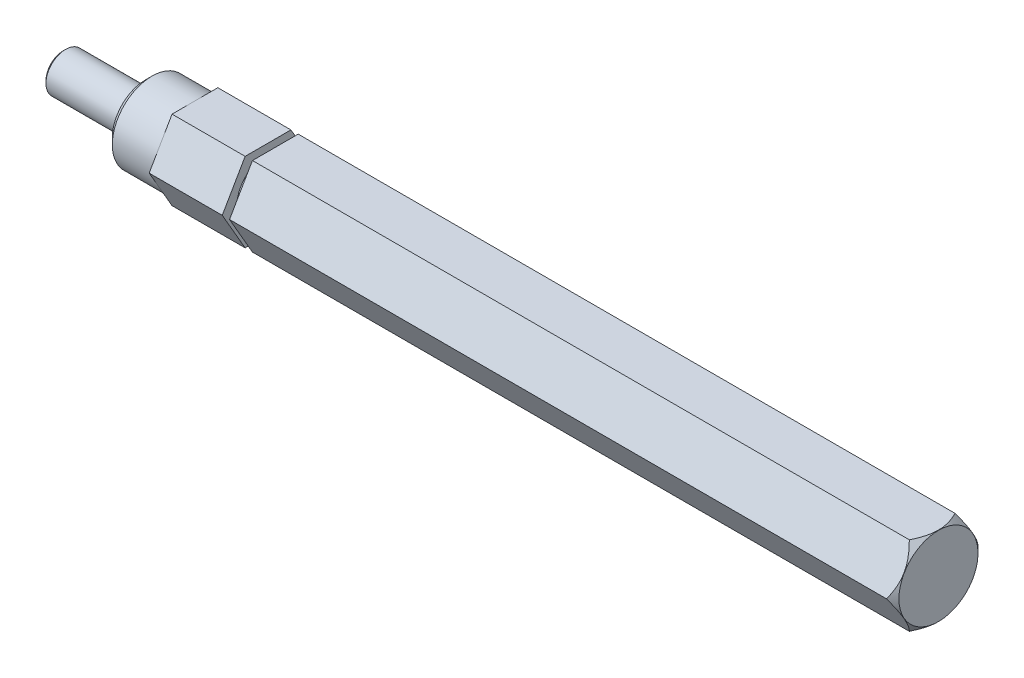
ISO-10303-21;
HEADER;
FILE_DESCRIPTION(('STEP AP214'),'2;1');
FILE_NAME('part.step','',(''),(''),'','','');
FILE_SCHEMA(('AUTOMOTIVE_DESIGN { 1 0 10303 214 1 1 1 1 }'));
ENDSEC;
DATA;
#1=APPLICATION_CONTEXT('core data for automotive mechanical design processes');
#2=APPLICATION_PROTOCOL_DEFINITION('international standard','automotive_design',2000,#1);
#3=PRODUCT_CONTEXT('',#1,'mechanical');
#4=PRODUCT('Part','Part','',(#3));
#5=PRODUCT_RELATED_PRODUCT_CATEGORY('part','',(#4));
#6=PRODUCT_DEFINITION_FORMATION('','',#4);
#7=PRODUCT_DEFINITION_CONTEXT('part definition',#1,'design');
#8=PRODUCT_DEFINITION('design','',#6,#7);
#9=PRODUCT_DEFINITION_SHAPE('','',#8);
#10=(LENGTH_UNIT() NAMED_UNIT(*) SI_UNIT(.MILLI.,.METRE.));
#11=(NAMED_UNIT(*) PLANE_ANGLE_UNIT() SI_UNIT($,.RADIAN.));
#12=(NAMED_UNIT(*) SI_UNIT($,.STERADIAN.) SOLID_ANGLE_UNIT());
#13=UNCERTAINTY_MEASURE_WITH_UNIT(LENGTH_MEASURE(1.E-05),#10,'distance_accuracy_value','');
#14=(GEOMETRIC_REPRESENTATION_CONTEXT(3) GLOBAL_UNCERTAINTY_ASSIGNED_CONTEXT((#13)) GLOBAL_UNIT_ASSIGNED_CONTEXT((#10,
#11,#12)) REPRESENTATION_CONTEXT('',''));
#15=CARTESIAN_POINT('',(0.,0.,0.));
#16=DIRECTION('',(0.,0.,1.));
#17=DIRECTION('',(1.,0.,0.));
#18=AXIS2_PLACEMENT_3D('',#15,#16,#17);
#19=CARTESIAN_POINT('',(-76.708,0.,0.));
#20=DIRECTION('',(-1.,0.,0.));
#21=DIRECTION('',(0.,0.,1.));
#22=AXIS2_PLACEMENT_3D('',#19,#20,#21);
#23=PLANE('',#22);
#24=CARTESIAN_POINT('',(-76.7079999999964,0.,0.));
#25=DIRECTION('',(1.,0.,0.));
#26=DIRECTION('',(0.,0.,-1.));
#27=AXIS2_PLACEMENT_3D('',#24,#25,#26);
#28=CIRCLE('',#27,2.76860000002443);
#29=CARTESIAN_POINT('',(-76.7079999999964,0.,-2.76860000002443));
#30=VERTEX_POINT('',#29);
#31=EDGE_CURVE('E19',#30,#30,#28,.T.);
#32=ORIENTED_EDGE('',*,*,#31,.F.);
#33=EDGE_LOOP('',(#32));
#34=FACE_BOUND('',#33,.T.);
#35=ADVANCED_FACE('F16',(#34),#23,.T.);
#36=CARTESIAN_POINT('',(-76.326999999992,0.,0.));
#37=DIRECTION('',(1.,0.,0.));
#38=DIRECTION('',(0.,0.,-1.));
#39=AXIS2_PLACEMENT_3D('',#36,#37,#38);
#40=CONICAL_SURFACE('',#39,3.149599999972,0.785398163322851);
#41=ORIENTED_EDGE('',*,*,#31,.T.);
#42=EDGE_LOOP('',(#41));
#43=FACE_BOUND('',#42,.T.);
#44=CARTESIAN_POINT('',(-76.327,0.,0.));
#45=DIRECTION('',(1.,0.,0.));
#46=DIRECTION('',(0.,0.,-1.));
#47=AXIS2_PLACEMENT_3D('',#44,#45,#46);
#48=CIRCLE('',#47,3.1496);
#49=CARTESIAN_POINT('',(-76.327,0.,-3.1496));
#50=VERTEX_POINT('',#49);
#51=EDGE_CURVE('E132',#50,#50,#48,.T.);
#52=ORIENTED_EDGE('',*,*,#51,.F.);
#53=EDGE_LOOP('',(#52));
#54=FACE_BOUND('',#53,.T.);
#55=ADVANCED_FACE('F258',(#43,#54),#40,.T.);
#56=CARTESIAN_POINT('',(-76.708,0.,0.));
#57=DIRECTION('',(1.,0.,0.));
#58=DIRECTION('',(0.,0.,-1.));
#59=AXIS2_PLACEMENT_3D('',#56,#57,#58);
#60=CYLINDRICAL_SURFACE('',#59,3.1496);
#61=ORIENTED_EDGE('',*,*,#51,.T.);
#62=EDGE_LOOP('',(#61));
#63=FACE_BOUND('',#62,.T.);
#64=CARTESIAN_POINT('',(-63.5,0.,0.));
#65=DIRECTION('',(1.,0.,0.));
#66=DIRECTION('',(0.,0.,-1.));
#67=AXIS2_PLACEMENT_3D('',#64,#65,#66);
#68=CIRCLE('',#67,3.1496);
#69=CARTESIAN_POINT('',(-63.5,0.,-3.1496));
#70=VERTEX_POINT('',#69);
#71=EDGE_CURVE('E135',#70,#70,#68,.F.);
#72=ORIENTED_EDGE('',*,*,#71,.T.);
#73=EDGE_LOOP('',(#72));
#74=FACE_BOUND('',#73,.T.);
#75=ADVANCED_FACE('F255',(#63,#74),#60,.T.);
#76=CARTESIAN_POINT('',(-63.5,0.,-7.33234841870824));
#77=DIRECTION('',(1.,0.,0.));
#78=DIRECTION('',(0.,0.,-1.));
#79=AXIS2_PLACEMENT_3D('',#76,#77,#78);
#80=PLANE('',#79);
#81=ORIENTED_EDGE('',*,*,#71,.F.);
#82=EDGE_LOOP('',(#81));
#83=FACE_BOUND('',#82,.T.);
#84=CARTESIAN_POINT('',(-63.4999999999764,0.,0.));
#85=DIRECTION('',(1.,0.,0.));
#86=DIRECTION('',(0.,0.,-1.));
#87=AXIS2_PLACEMENT_3D('',#84,#85,#86);
#88=CIRCLE('',#87,5.35000000002128);
#89=CARTESIAN_POINT('',(-63.4999999999764,0.,-5.35000000002128));
#90=VERTEX_POINT('',#89);
#91=EDGE_CURVE('E131',#90,#90,#88,.T.);
#92=ORIENTED_EDGE('',*,*,#91,.F.);
#93=EDGE_LOOP('',(#92));
#94=FACE_BOUND('',#93,.T.);
#95=ADVANCED_FACE('F251',(#83,#94),#80,.F.);
#96=CARTESIAN_POINT('',(-62.5000000001137,0.,0.));
#97=DIRECTION('',(1.,0.,0.));
#98=DIRECTION('',(0.,0.,-1.));
#99=AXIS2_PLACEMENT_3D('',#96,#97,#98);
#100=CONICAL_SURFACE('',#99,6.34999999988395,0.785398163397448);
#101=ORIENTED_EDGE('',*,*,#91,.T.);
#102=EDGE_LOOP('',(#101));
#103=FACE_BOUND('',#102,.T.);
#104=CARTESIAN_POINT('',(-62.5,0.,0.));
#105=DIRECTION('',(-1.,0.,0.));
#106=DIRECTION('',(0.,0.,1.));
#107=AXIS2_PLACEMENT_3D('',#104,#105,#106);
#108=CIRCLE('',#107,6.35);
#109=CARTESIAN_POINT('',(-62.5,0.,6.35));
#110=VERTEX_POINT('',#109);
#111=EDGE_CURVE('E95',#110,#110,#108,.F.);
#112=ORIENTED_EDGE('',*,*,#111,.F.);
#113=EDGE_LOOP('',(#112));
#114=FACE_BOUND('',#113,.T.);
#115=ADVANCED_FACE('F248',(#103,#114),#100,.T.);
#116=CARTESIAN_POINT('',(-55.6133,0.,0.));
#117=DIRECTION('',(-1.,0.,0.));
#118=DIRECTION('',(0.,0.,1.));
#119=AXIS2_PLACEMENT_3D('',#116,#117,#118);
#120=CYLINDRICAL_SURFACE('',#119,6.35);
#121=CARTESIAN_POINT('',(-55.6133,0.,0.));
#122=DIRECTION('',(-1.,0.,0.));
#123=DIRECTION('',(0.,0.,1.));
#124=AXIS2_PLACEMENT_3D('',#121,#122,#123);
#125=CIRCLE('',#124,6.35);
#126=CARTESIAN_POINT('',(-55.6133,-3.17499999999999,-5.49926131403119));
#127=VERTEX_POINT('',#126);
#128=CARTESIAN_POINT('',(-55.6133,3.175,-5.49926131403119));
#129=VERTEX_POINT('',#128);
#130=EDGE_CURVE('E81',#127,#129,#125,.F.);
#131=ORIENTED_EDGE('',*,*,#130,.F.);
#132=CARTESIAN_POINT('',(-55.6133,0.,0.));
#133=DIRECTION('',(-1.,0.,0.));
#134=DIRECTION('',(0.,0.,1.));
#135=AXIS2_PLACEMENT_3D('',#132,#133,#134);
#136=CIRCLE('',#135,6.35);
#137=CARTESIAN_POINT('',(-55.6133,-6.35000000000001,0.));
#138=VERTEX_POINT('',#137);
#139=EDGE_CURVE('E90',#138,#127,#136,.F.);
#140=ORIENTED_EDGE('',*,*,#139,.F.);
#141=CARTESIAN_POINT('',(-55.6133,0.,0.));
#142=DIRECTION('',(-1.,0.,0.));
#143=DIRECTION('',(0.,0.,1.));
#144=AXIS2_PLACEMENT_3D('',#141,#142,#143);
#145=CIRCLE('',#144,6.35);
#146=CARTESIAN_POINT('',(-55.6133,-3.175,5.49926131403118));
#147=VERTEX_POINT('',#146);
#148=EDGE_CURVE('E105',#147,#138,#145,.F.);
#149=ORIENTED_EDGE('',*,*,#148,.F.);
#150=CARTESIAN_POINT('',(-55.6133,0.,0.));
#151=DIRECTION('',(-1.,0.,0.));
#152=DIRECTION('',(0.,0.,1.));
#153=AXIS2_PLACEMENT_3D('',#150,#151,#152);
#154=CIRCLE('',#153,6.35);
#155=CARTESIAN_POINT('',(-55.6133,3.17499999999999,5.49926131403118));
#156=VERTEX_POINT('',#155);
#157=EDGE_CURVE('E106',#156,#147,#154,.F.);
#158=ORIENTED_EDGE('',*,*,#157,.F.);
#159=CARTESIAN_POINT('',(-55.6133,0.,0.));
#160=DIRECTION('',(-1.,0.,0.));
#161=DIRECTION('',(0.,0.,1.));
#162=AXIS2_PLACEMENT_3D('',#159,#160,#161);
#163=CIRCLE('',#162,6.35);
#164=CARTESIAN_POINT('',(-55.6133,6.35,0.));
#165=VERTEX_POINT('',#164);
#166=EDGE_CURVE('E455',#165,#156,#163,.F.);
#167=ORIENTED_EDGE('',*,*,#166,.F.);
#168=CARTESIAN_POINT('',(-55.6133,0.,0.));
#169=DIRECTION('',(-1.,0.,0.));
#170=DIRECTION('',(0.,0.,1.));
#171=AXIS2_PLACEMENT_3D('',#168,#169,#170);
#172=CIRCLE('',#171,6.35);
#173=EDGE_CURVE('E93',#129,#165,#172,.F.);
#174=ORIENTED_EDGE('',*,*,#173,.F.);
#175=EDGE_LOOP('',(#131,#140,#149,#158,#167,#174));
#176=FACE_BOUND('',#175,.T.);
#177=ORIENTED_EDGE('',*,*,#111,.T.);
#178=EDGE_LOOP('',(#177));
#179=FACE_BOUND('',#178,.T.);
#180=ADVANCED_FACE('F87',(#176,#179),#120,.T.);
#181=CARTESIAN_POINT('',(-55.6133,0.,0.));
#182=DIRECTION('',(-1.,0.,0.));
#183=DIRECTION('',(0.,0.,1.));
#184=AXIS2_PLACEMENT_3D('',#181,#182,#183);
#185=PLANE('',#184);
#186=DIRECTION('',(0.,-0.86602540378444,0.499999999999998));
#187=VECTOR('',#186,1.);
#188=CARTESIAN_POINT('',(-55.6133,-6.35000000000002,-3.66617420935411));
#189=LINE('',#188,#187);
#190=CARTESIAN_POINT('',(-55.6133000000001,0.,-7.33234841870823));
#191=VERTEX_POINT('',#190);
#192=EDGE_CURVE('E112',#191,#127,#189,.T.);
#193=ORIENTED_EDGE('',*,*,#192,.T.);
#194=ORIENTED_EDGE('',*,*,#130,.T.);
#195=DIRECTION('',(0.,-0.866025403784439,-0.5));
#196=VECTOR('',#195,1.);
#197=CARTESIAN_POINT('',(-55.6133000000001,0.,-7.33234841870824));
#198=LINE('',#197,#196);
#199=EDGE_CURVE('E120',#129,#191,#198,.T.);
#200=ORIENTED_EDGE('',*,*,#199,.T.);
#201=EDGE_LOOP('',(#193,#194,#200));
#202=FACE_BOUND('',#201,.T.);
#203=ADVANCED_FACE('F119',(#202),#185,.T.);
#204=CARTESIAN_POINT('',(-55.6133,0.,0.));
#205=DIRECTION('',(-1.,0.,0.));
#206=DIRECTION('',(0.,0.,1.));
#207=AXIS2_PLACEMENT_3D('',#204,#205,#206);
#208=PLANE('',#207);
#209=DIRECTION('',(0.,-0.866025403784439,-0.5));
#210=VECTOR('',#209,1.);
#211=CARTESIAN_POINT('',(-55.6133000000001,0.,-7.33234841870824));
#212=LINE('',#211,#210);
#213=CARTESIAN_POINT('',(-55.6133,6.35000000000001,-3.66617420935409));
#214=VERTEX_POINT('',#213);
#215=EDGE_CURVE('E117',#214,#129,#212,.T.);
#216=ORIENTED_EDGE('',*,*,#215,.T.);
#217=ORIENTED_EDGE('',*,*,#173,.T.);
#218=DIRECTION('',(0.,0.,-1.));
#219=VECTOR('',#218,1.);
#220=CARTESIAN_POINT('',(-55.6133,6.35,-3.66617420935412));
#221=LINE('',#220,#219);
#222=EDGE_CURVE('E414',#165,#214,#221,.T.);
#223=ORIENTED_EDGE('',*,*,#222,.T.);
#224=EDGE_LOOP('',(#216,#217,#223));
#225=FACE_BOUND('',#224,.T.);
#226=ADVANCED_FACE('F239',(#225),#208,.T.);
#227=CARTESIAN_POINT('',(-55.6133,0.,0.));
#228=DIRECTION('',(-1.,0.,0.));
#229=DIRECTION('',(0.,0.,1.));
#230=AXIS2_PLACEMENT_3D('',#227,#228,#229);
#231=PLANE('',#230);
#232=ORIENTED_EDGE('',*,*,#166,.T.);
#233=DIRECTION('',(0.,0.866025403784439,-0.499999999999999));
#234=VECTOR('',#233,1.);
#235=CARTESIAN_POINT('',(-55.6133,6.35,3.6661742093541));
#236=LINE('',#235,#234);
#237=CARTESIAN_POINT('',(-55.6133,6.34999999999999,3.66617420935411));
#238=VERTEX_POINT('',#237);
#239=EDGE_CURVE('E399',#156,#238,#236,.T.);
#240=ORIENTED_EDGE('',*,*,#239,.T.);
#241=DIRECTION('',(0.,0.,-1.));
#242=VECTOR('',#241,1.);
#243=CARTESIAN_POINT('',(-55.6133,6.35,-3.66617420935412));
#244=LINE('',#243,#242);
#245=EDGE_CURVE('E411',#238,#165,#244,.T.);
#246=ORIENTED_EDGE('',*,*,#245,.T.);
#247=EDGE_LOOP('',(#232,#240,#246));
#248=FACE_BOUND('',#247,.T.);
#249=ADVANCED_FACE('F235',(#248),#231,.T.);
#250=CARTESIAN_POINT('',(-55.6133,0.,0.));
#251=DIRECTION('',(-1.,0.,0.));
#252=DIRECTION('',(0.,0.,1.));
#253=AXIS2_PLACEMENT_3D('',#250,#251,#252);
#254=PLANE('',#253);
#255=ORIENTED_EDGE('',*,*,#157,.T.);
#256=DIRECTION('',(0.,0.866025403784439,0.5));
#257=VECTOR('',#256,1.);
#258=CARTESIAN_POINT('',(-55.6133000000001,0.,7.33234841870822));
#259=LINE('',#258,#257);
#260=CARTESIAN_POINT('',(-55.6133000000001,0.,7.33234841870822));
#261=VERTEX_POINT('',#260);
#262=EDGE_CURVE('E370',#147,#261,#259,.T.);
#263=ORIENTED_EDGE('',*,*,#262,.T.);
#264=DIRECTION('',(0.,0.866025403784439,-0.499999999999999));
#265=VECTOR('',#264,1.);
#266=CARTESIAN_POINT('',(-55.6133,6.35,3.6661742093541));
#267=LINE('',#266,#265);
#268=EDGE_CURVE('E396',#261,#156,#267,.T.);
#269=ORIENTED_EDGE('',*,*,#268,.T.);
#270=EDGE_LOOP('',(#255,#263,#269));
#271=FACE_BOUND('',#270,.T.);
#272=ADVANCED_FACE('F232',(#271),#254,.T.);
#273=CARTESIAN_POINT('',(-55.6133,0.,0.));
#274=DIRECTION('',(-1.,0.,0.));
#275=DIRECTION('',(0.,0.,1.));
#276=AXIS2_PLACEMENT_3D('',#273,#274,#275);
#277=PLANE('',#276);
#278=DIRECTION('',(0.,0.,1.));
#279=VECTOR('',#278,1.);
#280=CARTESIAN_POINT('',(-55.6133,-6.35000000000002,3.66617420935409));
#281=LINE('',#280,#279);
#282=CARTESIAN_POINT('',(-55.6133,-6.35000000000003,-3.6661742093541));
#283=VERTEX_POINT('',#282);
#284=EDGE_CURVE('E104',#283,#138,#281,.T.);
#285=ORIENTED_EDGE('',*,*,#284,.T.);
#286=ORIENTED_EDGE('',*,*,#139,.T.);
#287=DIRECTION('',(0.,-0.86602540378444,0.499999999999998));
#288=VECTOR('',#287,1.);
#289=CARTESIAN_POINT('',(-55.6133,-6.35000000000002,-3.66617420935411));
#290=LINE('',#289,#288);
#291=EDGE_CURVE('E102',#127,#283,#290,.T.);
#292=ORIENTED_EDGE('',*,*,#291,.T.);
#293=EDGE_LOOP('',(#285,#286,#292));
#294=FACE_BOUND('',#293,.T.);
#295=ADVANCED_FACE('F101',(#294),#277,.T.);
#296=CARTESIAN_POINT('',(-55.6133,0.,0.));
#297=DIRECTION('',(-1.,0.,0.));
#298=DIRECTION('',(0.,0.,1.));
#299=AXIS2_PLACEMENT_3D('',#296,#297,#298);
#300=PLANE('',#299);
#301=ORIENTED_EDGE('',*,*,#148,.T.);
#302=DIRECTION('',(0.,0.,1.));
#303=VECTOR('',#302,1.);
#304=CARTESIAN_POINT('',(-55.6133,-6.35000000000002,3.66617420935409));
#305=LINE('',#304,#303);
#306=CARTESIAN_POINT('',(-55.6133,-6.35000000000002,3.66617420935407));
#307=VERTEX_POINT('',#306);
#308=EDGE_CURVE('E355',#138,#307,#305,.T.);
#309=ORIENTED_EDGE('',*,*,#308,.T.);
#310=DIRECTION('',(0.,0.866025403784439,0.5));
#311=VECTOR('',#310,1.);
#312=CARTESIAN_POINT('',(-55.6133000000001,0.,7.33234841870822));
#313=LINE('',#312,#311);
#314=EDGE_CURVE('E367',#307,#147,#313,.T.);
#315=ORIENTED_EDGE('',*,*,#314,.T.);
#316=EDGE_LOOP('',(#301,#309,#315));
#317=FACE_BOUND('',#316,.T.);
#318=ADVANCED_FACE('F226',(#317),#300,.T.);
#319=CARTESIAN_POINT('',(63.5,-6.35000000000002,-3.66617420935411));
#320=DIRECTION('',(0.,0.499999999999998,0.86602540378444));
#321=DIRECTION('',(0.,-0.86602540378444,0.499999999999998));
#322=AXIS2_PLACEMENT_3D('',#319,#320,#321);
#323=PLANE('',#322);
#324=DIRECTION('',(1.,0.,0.));
#325=VECTOR('',#324,1.);
#326=CARTESIAN_POINT('',(63.5,-6.35000000000002,-3.66617420935411));
#327=LINE('',#326,#325);
#328=CARTESIAN_POINT('',(-43.9039,-6.35000000000002,-3.66617420935411));
#329=VERTEX_POINT('',#328);
#330=EDGE_CURVE('E116',#329,#283,#327,.F.);
#331=ORIENTED_EDGE('',*,*,#330,.T.);
#332=ORIENTED_EDGE('',*,*,#291,.F.);
#333=ORIENTED_EDGE('',*,*,#192,.F.);
#334=DIRECTION('',(1.,0.,0.));
#335=VECTOR('',#334,1.);
#336=CARTESIAN_POINT('',(63.5,0.,-7.33234841870822));
#337=LINE('',#336,#335);
#338=CARTESIAN_POINT('',(-43.9039,0.,-7.33234841870823));
#339=VERTEX_POINT('',#338);
#340=EDGE_CURVE('E415',#191,#339,#337,.T.);
#341=ORIENTED_EDGE('',*,*,#340,.T.);
#342=DIRECTION('',(0.,0.86602540378444,-0.499999999999999));
#343=VECTOR('',#342,1.);
#344=CARTESIAN_POINT('',(-43.9039,-6.35000000000002,-3.66617420935411));
#345=LINE('',#344,#343);
#346=EDGE_CURVE('E353',#329,#339,#345,.T.);
#347=ORIENTED_EDGE('',*,*,#346,.F.);
#348=EDGE_LOOP('',(#331,#332,#333,#341,#347));
#349=FACE_BOUND('',#348,.T.);
#350=ADVANCED_FACE('F110',(#349),#323,.F.);
#351=CARTESIAN_POINT('',(63.5,0.,-7.33234841870824));
#352=DIRECTION('',(0.,-0.5,0.866025403784439));
#353=DIRECTION('',(0.,-0.866025403784439,-0.5));
#354=AXIS2_PLACEMENT_3D('',#351,#352,#353);
#355=PLANE('',#354);
#356=ORIENTED_EDGE('',*,*,#340,.F.);
#357=ORIENTED_EDGE('',*,*,#199,.F.);
#358=ORIENTED_EDGE('',*,*,#215,.F.);
#359=DIRECTION('',(1.,0.,0.));
#360=VECTOR('',#359,1.);
#361=CARTESIAN_POINT('',(63.5,6.35,-3.66617420935407));
#362=LINE('',#361,#360);
#363=CARTESIAN_POINT('',(-43.9039,6.35,-3.66617420935411));
#364=VERTEX_POINT('',#363);
#365=EDGE_CURVE('E400',#214,#364,#362,.T.);
#366=ORIENTED_EDGE('',*,*,#365,.T.);
#367=DIRECTION('',(0.,0.866025403784439,0.499999999999999));
#368=VECTOR('',#367,1.);
#369=CARTESIAN_POINT('',(-43.9039,0.,-7.33234841870824));
#370=LINE('',#369,#368);
#371=EDGE_CURVE('E350',#339,#364,#370,.T.);
#372=ORIENTED_EDGE('',*,*,#371,.F.);
#373=EDGE_LOOP('',(#356,#357,#358,#366,#372));
#374=FACE_BOUND('',#373,.T.);
#375=ADVANCED_FACE('F219',(#374),#355,.F.);
#376=CARTESIAN_POINT('',(63.5,6.35,-3.66617420935412));
#377=DIRECTION('',(0.,-1.,0.));
#378=DIRECTION('',(0.,0.,-1.));
#379=AXIS2_PLACEMENT_3D('',#376,#377,#378);
#380=PLANE('',#379);
#381=ORIENTED_EDGE('',*,*,#365,.F.);
#382=ORIENTED_EDGE('',*,*,#222,.F.);
#383=ORIENTED_EDGE('',*,*,#245,.F.);
#384=DIRECTION('',(1.,0.,0.));
#385=VECTOR('',#384,1.);
#386=CARTESIAN_POINT('',(63.5,6.34999999999997,3.66617420935412));
#387=LINE('',#386,#385);
#388=CARTESIAN_POINT('',(-43.9039,6.34999999999999,3.6661742093541));
#389=VERTEX_POINT('',#388);
#390=EDGE_CURVE('E371',#238,#389,#387,.T.);
#391=ORIENTED_EDGE('',*,*,#390,.T.);
#392=DIRECTION('',(0.,0.,-1.));
#393=VECTOR('',#392,1.);
#394=CARTESIAN_POINT('',(-43.9039,6.35,0.));
#395=LINE('',#394,#393);
#396=EDGE_CURVE('E347',#364,#389,#395,.F.);
#397=ORIENTED_EDGE('',*,*,#396,.F.);
#398=EDGE_LOOP('',(#381,#382,#383,#391,#397));
#399=FACE_BOUND('',#398,.T.);
#400=ADVANCED_FACE('F215',(#399),#380,.F.);
#401=CARTESIAN_POINT('',(63.5,6.35,3.6661742093541));
#402=DIRECTION('',(0.,-0.499999999999999,-0.866025403784439));
#403=DIRECTION('',(0.,0.866025403784439,-0.499999999999999));
#404=AXIS2_PLACEMENT_3D('',#401,#402,#403);
#405=PLANE('',#404);
#406=ORIENTED_EDGE('',*,*,#390,.F.);
#407=ORIENTED_EDGE('',*,*,#239,.F.);
#408=ORIENTED_EDGE('',*,*,#268,.F.);
#409=DIRECTION('',(1.,0.,0.));
#410=VECTOR('',#409,1.);
#411=CARTESIAN_POINT('',(63.5,0.,7.33234841870822));
#412=LINE('',#411,#410);
#413=CARTESIAN_POINT('',(-43.9039,0.,7.33234841870822));
#414=VERTEX_POINT('',#413);
#415=EDGE_CURVE('E375',#261,#414,#412,.T.);
#416=ORIENTED_EDGE('',*,*,#415,.T.);
#417=DIRECTION('',(0.,-0.866025403784439,0.499999999999999));
#418=VECTOR('',#417,1.);
#419=CARTESIAN_POINT('',(-43.9039,6.35,3.6661742093541));
#420=LINE('',#419,#418);
#421=EDGE_CURVE('E344',#389,#414,#420,.T.);
#422=ORIENTED_EDGE('',*,*,#421,.F.);
#423=EDGE_LOOP('',(#406,#407,#408,#416,#422));
#424=FACE_BOUND('',#423,.T.);
#425=ADVANCED_FACE('F211',(#424),#405,.F.);
#426=CARTESIAN_POINT('',(63.5,0.,7.33234841870822));
#427=DIRECTION('',(0.,0.5,-0.866025403784439));
#428=DIRECTION('',(0.,0.866025403784439,0.5));
#429=AXIS2_PLACEMENT_3D('',#426,#427,#428);
#430=PLANE('',#429);
#431=ORIENTED_EDGE('',*,*,#415,.F.);
#432=ORIENTED_EDGE('',*,*,#262,.F.);
#433=ORIENTED_EDGE('',*,*,#314,.F.);
#434=DIRECTION('',(1.,0.,0.));
#435=VECTOR('',#434,1.);
#436=CARTESIAN_POINT('',(63.5,-6.35000000000002,3.66617420935404));
#437=LINE('',#436,#435);
#438=CARTESIAN_POINT('',(-43.9039,-6.35000000000002,3.66617420935408));
#439=VERTEX_POINT('',#438);
#440=EDGE_CURVE('E360',#307,#439,#437,.T.);
#441=ORIENTED_EDGE('',*,*,#440,.T.);
#442=DIRECTION('',(0.,-0.866025403784439,-0.5));
#443=VECTOR('',#442,1.);
#444=CARTESIAN_POINT('',(-43.9039,0.,7.33234841870822));
#445=LINE('',#444,#443);
#446=EDGE_CURVE('E340',#414,#439,#445,.T.);
#447=ORIENTED_EDGE('',*,*,#446,.F.);
#448=EDGE_LOOP('',(#431,#432,#433,#441,#447));
#449=FACE_BOUND('',#448,.T.);
#450=ADVANCED_FACE('F207',(#449),#430,.F.);
#451=CARTESIAN_POINT('',(63.5,-6.35000000000002,3.66617420935409));
#452=DIRECTION('',(0.,1.,0.));
#453=DIRECTION('',(0.,0.,1.));
#454=AXIS2_PLACEMENT_3D('',#451,#452,#453);
#455=PLANE('',#454);
#456=ORIENTED_EDGE('',*,*,#440,.F.);
#457=ORIENTED_EDGE('',*,*,#308,.F.);
#458=ORIENTED_EDGE('',*,*,#284,.F.);
#459=ORIENTED_EDGE('',*,*,#330,.F.);
#460=DIRECTION('',(0.,0.,-1.));
#461=VECTOR('',#460,1.);
#462=CARTESIAN_POINT('',(-43.9039,-6.35000000000001,0.));
#463=LINE('',#462,#461);
#464=EDGE_CURVE('E343',#439,#329,#463,.T.);
#465=ORIENTED_EDGE('',*,*,#464,.F.);
#466=EDGE_LOOP('',(#456,#457,#458,#459,#465));
#467=FACE_BOUND('',#466,.T.);
#468=ADVANCED_FACE('F203',(#467),#455,.F.);
#469=CARTESIAN_POINT('',(-43.9039,7.5692,0.));
#470=DIRECTION('',(1.,0.,0.));
#471=DIRECTION('',(0.,0.,-1.));
#472=AXIS2_PLACEMENT_3D('',#469,#470,#471);
#473=PLANE('',#472);
#474=ORIENTED_EDGE('',*,*,#446,.T.);
#475=ORIENTED_EDGE('',*,*,#464,.T.);
#476=ORIENTED_EDGE('',*,*,#346,.T.);
#477=ORIENTED_EDGE('',*,*,#371,.T.);
#478=ORIENTED_EDGE('',*,*,#396,.T.);
#479=ORIENTED_EDGE('',*,*,#421,.T.);
#480=EDGE_LOOP('',(#474,#475,#476,#477,#478,#479));
#481=FACE_BOUND('',#480,.T.);
#482=CARTESIAN_POINT('',(-43.9039,0.,0.));
#483=DIRECTION('',(-1.,0.,0.));
#484=DIRECTION('',(0.,0.,1.));
#485=AXIS2_PLACEMENT_3D('',#482,#483,#484);
#486=CIRCLE('',#485,5.0292);
#487=CARTESIAN_POINT('',(-43.9039,0.,5.0292));
#488=VERTEX_POINT('',#487);
#489=EDGE_CURVE('E188',#488,#488,#486,.F.);
#490=ORIENTED_EDGE('',*,*,#489,.F.);
#491=EDGE_LOOP('',(#490));
#492=FACE_BOUND('',#491,.T.);
#493=ADVANCED_FACE('F199',(#481,#492),#473,.T.);
#494=CARTESIAN_POINT('',(-78.984221990192,0.,0.));
#495=DIRECTION('',(-1.,0.,0.));
#496=DIRECTION('',(0.,0.,1.));
#497=AXIS2_PLACEMENT_3D('',#494,#495,#496);
#498=CYLINDRICAL_SURFACE('',#497,5.0292);
#499=CARTESIAN_POINT('',(-42.7355,0.,0.));
#500=DIRECTION('',(-1.,0.,0.));
#501=DIRECTION('',(0.,0.,1.));
#502=AXIS2_PLACEMENT_3D('',#499,#500,#501);
#503=CIRCLE('',#502,5.0292);
#504=CARTESIAN_POINT('',(-42.7355,0.,5.0292));
#505=VERTEX_POINT('',#504);
#506=EDGE_CURVE('E319',#505,#505,#503,.F.);
#507=ORIENTED_EDGE('',*,*,#506,.F.);
#508=EDGE_LOOP('',(#507));
#509=FACE_BOUND('',#508,.T.);
#510=ORIENTED_EDGE('',*,*,#489,.T.);
#511=EDGE_LOOP('',(#510));
#512=FACE_BOUND('',#511,.T.);
#513=ADVANCED_FACE('F195',(#509,#512),#498,.T.);
#514=CARTESIAN_POINT('',(63.5,-6.35000000000002,-3.66617420935411));
#515=DIRECTION('',(0.,0.499999999999998,0.86602540378444));
#516=DIRECTION('',(0.,-0.86602540378444,0.499999999999998));
#517=AXIS2_PLACEMENT_3D('',#514,#515,#516);
#518=PLANE('',#517);
#519=CARTESIAN_POINT('',(62.5000000000251,-6.35000000001246,-3.66617420934361));
#520=CARTESIAN_POINT('',(62.5630243488132,-6.24082224128489,-3.72920801773658));
#521=CARTESIAN_POINT('',(62.6241144550649,-6.13080532071175,-3.79272631644579));
#522=CARTESIAN_POINT('',(62.7418378426297,-5.90892855599337,-3.92082692628354));
#523=CARTESIAN_POINT('',(62.7984686901009,-5.79706774518944,-3.98540979551274));
#524=CARTESIAN_POINT('',(62.9612726486637,-5.45743359870881,-4.18149766140897));
#525=CARTESIAN_POINT('',(63.0596627844808,-5.22678528314502,-4.31466252848803));
#526=CARTESIAN_POINT('',(63.2281485575353,-4.76166466154775,-4.58320004457298));
#527=CARTESIAN_POINT('',(63.2986686148327,-4.52731120638811,-4.71850407499486));
#528=CARTESIAN_POINT('',(63.3802425803222,-4.17192864306111,-4.92368429359699));
#529=CARTESIAN_POINT('',(63.4033886424388,-4.05294462116126,-4.99237975067014));
#530=CARTESIAN_POINT('',(63.4410883456707,-3.81396926695451,-5.1303522357511));
#531=CARTESIAN_POINT('',(63.4556432705364,-3.69397808786349,-5.19962917529968));
#532=CARTESIAN_POINT('',(63.4800473333972,-3.40156567352281,-5.36845356143365));
#533=CARTESIAN_POINT('',(63.4851670463065,-3.22882935730444,-5.46818292010115));
#534=CARTESIAN_POINT('',(63.4765691176406,-2.88366816817396,-5.66746182555945));
#535=CARTESIAN_POINT('',(63.4628448734034,-2.71124342563288,-5.76701129708049));
#536=CARTESIAN_POINT('',(63.4173680224393,-2.36801965567892,-5.96517163305569));
#537=CARTESIAN_POINT('',(63.3855952591375,-2.19722266334729,-6.06378132255513));
#538=CARTESIAN_POINT('',(63.3057487124252,-1.85856430449202,-6.25930581720353));
#539=CARTESIAN_POINT('',(63.257676179171,-1.69070271386755,-6.35622075173717));
#540=CARTESIAN_POINT('',(63.1587833928241,-1.39273873571613,-6.5282503347317));
#541=CARTESIAN_POINT('',(63.1105654677278,-1.26197616672401,-6.60374613913923));
#542=CARTESIAN_POINT('',(63.0063605790637,-1.00279800721751,-6.75338271929838));
#543=CARTESIAN_POINT('',(62.9503733812648,-0.874382487595074,-6.82752345412052));
#544=CARTESIAN_POINT('',(62.8318846841198,-0.620302927697594,-6.97421635642291));
#545=CARTESIAN_POINT('',(62.7694036729165,-0.494631661690769,-7.04677269568135));
#546=CARTESIAN_POINT('',(62.6387473881741,-0.245615832684075,-7.19054205159085));
#547=CARTESIAN_POINT('',(62.57057560442,-0.122269899780851,-7.26175585915597));
#548=CARTESIAN_POINT('',(62.5000000000243,1.80847613580905E-11,-7.33234841871867));
#549=B_SPLINE_CURVE_WITH_KNOTS('',3,(#519,#520,#521,#522,#523,#524,#525,#526,#527,#528,#529,
#530,#531,#532,#533,#534,#535,#536,#537,#538,#539,#540,#541,#542,#543,#544,#545,#546,#547,#548),
.UNSPECIFIED.,.F.,.F.,(4,2,2,2,2,2,2,2,2,2,2,2,2,2,4),(0.,0.422806209108107,0.845841606931463,
1.69647868442686,2.53361052128564,2.95135562071456,3.36903828181059,3.96668147991982,
4.56453413738439,5.16305579271073,5.7615315531297,6.23681974407244,6.71212226731044,
7.18596827579814,7.6595258100969),.UNSPECIFIED.);
#550=CARTESIAN_POINT('',(62.5000000000306,-6.35000000000723,-3.66617420934995));
#551=VERTEX_POINT('',#550);
#552=CARTESIAN_POINT('',(62.4999999999147,0.,-7.33234841873404));
#553=VERTEX_POINT('',#552);
#554=EDGE_CURVE('E181',#551,#553,#549,.T.);
#555=ORIENTED_EDGE('',*,*,#554,.F.);
#556=DIRECTION('',(1.,0.,0.));
#557=VECTOR('',#556,1.);
#558=CARTESIAN_POINT('',(63.5,-6.35000000000002,-3.66617420935411));
#559=LINE('',#558,#557);
#560=CARTESIAN_POINT('',(-42.7355,-6.35000000000002,-3.66617420935411));
#561=VERTEX_POINT('',#560);
#562=EDGE_CURVE('E316',#551,#561,#559,.F.);
#563=ORIENTED_EDGE('',*,*,#562,.T.);
#564=DIRECTION('',(0.,-0.86602540378444,0.499999999999999));
#565=VECTOR('',#564,1.);
#566=CARTESIAN_POINT('',(-42.7355,0.,-7.33234841870824));
#567=LINE('',#566,#565);
#568=CARTESIAN_POINT('',(-42.7355,0.,-7.33234841870824));
#569=VERTEX_POINT('',#568);
#570=EDGE_CURVE('E325',#569,#561,#567,.T.);
#571=ORIENTED_EDGE('',*,*,#570,.F.);
#572=DIRECTION('',(1.,0.,0.));
#573=VECTOR('',#572,1.);
#574=CARTESIAN_POINT('',(63.5,0.,-7.33234841870824));
#575=LINE('',#574,#573);
#576=EDGE_CURVE('E187',#569,#553,#575,.T.);
#577=ORIENTED_EDGE('',*,*,#576,.T.);
#578=EDGE_LOOP('',(#555,#563,#571,#577));
#579=FACE_BOUND('',#578,.T.);
#580=ADVANCED_FACE('F189',(#579),#518,.F.);
#581=CARTESIAN_POINT('',(63.5,0.,-7.33234841870824));
#582=DIRECTION('',(1.,0.,0.));
#583=DIRECTION('',(0.,0.,-1.));
#584=AXIS2_PLACEMENT_3D('',#581,#582,#583);
#585=PLANE('',#584);
#586=CARTESIAN_POINT('',(63.5000000000332,0.,0.));
#587=DIRECTION('',(-1.,0.,0.));
#588=DIRECTION('',(0.,0.,1.));
#589=AXIS2_PLACEMENT_3D('',#586,#587,#588);
#590=CIRCLE('',#589,6.33234841876629);
#591=CARTESIAN_POINT('',(63.5000000000332,0.,6.33234841876629));
#592=VERTEX_POINT('',#591);
#593=EDGE_CURVE('E309',#592,#592,#590,.T.);
#594=ORIENTED_EDGE('',*,*,#593,.F.);
#595=EDGE_LOOP('',(#594));
#596=FACE_BOUND('',#595,.T.);
#597=ADVANCED_FACE('F194',(#596),#585,.T.);
#598=CARTESIAN_POINT('',(63.5,0.,-7.33234841870824));
#599=DIRECTION('',(0.,-0.5,0.866025403784439));
#600=DIRECTION('',(0.,-0.866025403784439,-0.5));
#601=AXIS2_PLACEMENT_3D('',#598,#599,#600);
#602=PLANE('',#601);
#603=CARTESIAN_POINT('',(62.5000000000249,-1.75913259185031E-11,-7.33234841871991));
#604=CARTESIAN_POINT('',(62.5630243487969,0.109177758685031,-7.26931461034247));
#605=CARTESIAN_POINT('',(62.6241144550341,0.219194679232281,-7.2057963116487));
#606=CARTESIAN_POINT('',(62.7418378425729,0.441071443897422,-7.07769570184206));
#607=CARTESIAN_POINT('',(62.7984686900324,0.552932254674005,-7.01311283262853));
#608=CARTESIAN_POINT('',(62.9612726485645,0.892566401071528,-6.81702496678009));
#609=CARTESIAN_POINT('',(63.0596627843664,1.12321471657824,-6.68386009973407));
#610=CARTESIAN_POINT('',(63.2281485574468,1.58833533816981,-6.41532258365248));
#611=CARTESIAN_POINT('',(63.2986686147724,1.82268879338436,-6.28001855319887));
#612=CARTESIAN_POINT('',(63.3802425802934,2.17807135679596,-6.07483833454788));
#613=CARTESIAN_POINT('',(63.4033886424186,2.29705537872428,-6.0061428774583));
#614=CARTESIAN_POINT('',(63.4410883456638,2.53603073298853,-5.86817039234415));
#615=CARTESIAN_POINT('',(63.4556432705341,2.65602191210859,-5.7988934527788));
#616=CARTESIAN_POINT('',(63.480047333399,2.94843432649883,-5.63006906661621));
#617=CARTESIAN_POINT('',(63.4851670463077,3.12117064273771,-5.53033970793687));
#618=CARTESIAN_POINT('',(63.4765691176362,3.46633183190935,-5.33106080245481));
#619=CARTESIAN_POINT('',(63.462844873394,3.63875657447108,-5.23151133092184));
#620=CARTESIAN_POINT('',(63.4173680224212,3.98198034442486,-5.03335099494675));
#621=CARTESIAN_POINT('',(63.38559525912,4.15277733673608,-4.93474130545909));
#622=CARTESIAN_POINT('',(63.3057487124129,4.49143569555101,-4.73921681083398));
#623=CARTESIAN_POINT('',(63.2576761791634,4.65929728615556,-4.64230187631184));
#624=CARTESIAN_POINT('',(63.1587833946502,4.95726125878189,-4.47027229650722));
#625=CARTESIAN_POINT('',(63.1105654717517,5.08802382236314,-4.39477649522366));
#626=CARTESIAN_POINT('',(63.0063605880876,5.3472019712425,-4.2451399212001));
#627=CARTESIAN_POINT('',(62.950373393091,5.47561748564878,-4.1709991893895));
#628=CARTESIAN_POINT('',(62.8318847020062,5.7296970353421,-4.02430629297848));
#629=CARTESIAN_POINT('',(62.7694036940583,5.85536829635997,-3.95174995660042));
#630=CARTESIAN_POINT('',(62.6387474161846,6.10438411557885,-3.80798060634192));
#631=CARTESIAN_POINT('',(62.5705756360429,6.22773004368286,-3.73676680154763));
#632=CARTESIAN_POINT('',(62.5000000353917,6.34999993875988,-3.66617424471112));
#633=B_SPLINE_CURVE_WITH_KNOTS('',3,(#603,#604,#605,#606,#607,#608,#609,#610,#611,#612,#613,
#614,#615,#616,#617,#618,#619,#620,#621,#622,#623,#624,#625,#626,#627,#628,#629,#630,#631,#632),
.UNSPECIFIED.,.F.,.F.,(4,2,2,2,2,2,2,2,2,2,2,2,2,2,4),(0.,0.422806209007845,0.845841606730648,
1.69647868402592,2.53361052108901,2.9513556206193,3.36903828181662,3.96668147999655,
4.56453413753302,5.16305579279032,5.76153155313653,6.23681972424801,6.71212222763233,
7.18596821639673,7.65952573103562),.UNSPECIFIED.);
#634=CARTESIAN_POINT('',(62.5000000177132,6.34999996938002,-3.66617422703258));
#635=VERTEX_POINT('',#634);
#636=EDGE_CURVE('E164',#553,#635,#633,.T.);
#637=ORIENTED_EDGE('',*,*,#636,.F.);
#638=ORIENTED_EDGE('',*,*,#576,.F.);
#639=DIRECTION('',(0.,-0.866025403784439,-0.499999999999999));
#640=VECTOR('',#639,1.);
#641=CARTESIAN_POINT('',(-42.7355,6.35,-3.66617420935412));
#642=LINE('',#641,#640);
#643=CARTESIAN_POINT('',(-42.7355,6.35,-3.66617420935412));
#644=VERTEX_POINT('',#643);
#645=EDGE_CURVE('E313',#644,#569,#642,.T.);
#646=ORIENTED_EDGE('',*,*,#645,.F.);
#647=DIRECTION('',(1.,0.,0.));
#648=VECTOR('',#647,1.);
#649=CARTESIAN_POINT('',(63.5,6.35,-3.66617420935412));
#650=LINE('',#649,#648);
#651=EDGE_CURVE('E306',#644,#635,#650,.T.);
#652=ORIENTED_EDGE('',*,*,#651,.T.);
#653=EDGE_LOOP('',(#637,#638,#646,#652));
#654=FACE_BOUND('',#653,.T.);
#655=ADVANCED_FACE('F498',(#654),#602,.F.);
#656=CARTESIAN_POINT('',(63.5,-6.35000000000002,3.66617420935409));
#657=DIRECTION('',(0.,1.,0.));
#658=DIRECTION('',(0.,0.,1.));
#659=AXIS2_PLACEMENT_3D('',#656,#657,#658);
#660=PLANE('',#659);
#661=CARTESIAN_POINT('',(62.5000000000278,-6.35000000000002,3.66617420936801));
#662=CARTESIAN_POINT('',(62.563024348815,-6.35000000000002,3.54010659258486));
#663=CARTESIAN_POINT('',(62.6241144550663,-6.35000000000002,3.41306999516767));
#664=CARTESIAN_POINT('',(62.7418378426308,-6.35000000000002,3.15686877549313));
#665=CARTESIAN_POINT('',(62.798468690102,-6.35000000000002,3.02770303703447));
#666=CARTESIAN_POINT('',(62.9612726486647,-6.35000000000002,2.63552730524165));
#667=CARTESIAN_POINT('',(63.0596627844816,-6.35000000000002,2.36919757108382));
#668=CARTESIAN_POINT('',(63.2281485575359,-6.35000000000002,1.83212253891418));
#669=CARTESIAN_POINT('',(63.2986686148332,-6.35000000000002,1.56151447807039));
#670=CARTESIAN_POINT('',(63.3802425803225,-6.35000000000002,1.15115404086619));
#671=CARTESIAN_POINT('',(63.4033886424391,-6.35000000000002,1.01376312671992));
#672=CARTESIAN_POINT('',(63.441088345671,-6.35000000000002,0.737818156558072));
#673=CARTESIAN_POINT('',(63.4556432705366,-6.35000000000002,0.599264277460947));
#674=CARTESIAN_POINT('',(63.4800473333973,-6.35000000000002,0.261615505192991));
#675=CARTESIAN_POINT('',(63.4851670463065,-6.35000000000002,0.0621567878579527));
#676=CARTESIAN_POINT('',(63.4765691176404,-6.35000000000002,-0.3364010230587));
#677=CARTESIAN_POINT('',(63.4628448734032,-6.35000000000002,-0.535499966100824));
#678=CARTESIAN_POINT('',(63.417368022439,-6.35000000000002,-0.931820638051264));
#679=CARTESIAN_POINT('',(63.3855952591371,-6.35000000000002,-1.12904001705016));
#680=CARTESIAN_POINT('',(63.3057487124247,-6.35000000000002,-1.520089006347));
#681=CARTESIAN_POINT('',(63.2576761791704,-6.35000000000002,-1.71391887541429));
#682=CARTESIAN_POINT('',(63.1587833928236,-6.35000000000002,-2.05797804140276));
#683=CARTESIAN_POINT('',(63.1105654677274,-6.35000000000002,-2.20896965021722));
#684=CARTESIAN_POINT('',(63.0063605790637,-6.35000000000002,-2.50824281053434));
#685=CARTESIAN_POINT('',(62.950373381265,-6.35000000000002,-2.65652428017804));
#686=CARTESIAN_POINT('',(62.8318846841205,-6.35000000000002,-2.94991008478169));
#687=CARTESIAN_POINT('',(62.7694036729175,-6.35000000000002,-3.09502276329803));
#688=CARTESIAN_POINT('',(62.6387473881757,-6.35000000000002,-3.38256147511594));
#689=CARTESIAN_POINT('',(62.5705756044219,-6.35000000000002,-3.52498909024565));
#690=CARTESIAN_POINT('',(62.5000000000265,-6.35000000000002,-3.66617420937054));
#691=B_SPLINE_CURVE_WITH_KNOTS('',3,(#661,#662,#663,#664,#665,#666,#667,#668,#669,#670,#671,
#672,#673,#674,#675,#676,#677,#678,#679,#680,#681,#682,#683,#684,#685,#686,#687,#688,#689,#690),
.UNSPECIFIED.,.F.,.F.,(4,2,2,2,2,2,2,2,2,2,2,2,2,2,4),(0.,0.42280620910792,0.845841606931108,
1.69647868442621,2.5336105212848,2.95135562071361,3.36903828180953,3.96668147991885,
4.56453413738353,5.16305579270995,5.76153155312901,6.23681974406989,6.71212226730603,
7.18596827579189,7.65952581008883),.UNSPECIFIED.);
#692=CARTESIAN_POINT('',(62.5000000000313,-6.34999999999999,3.66617420936107));
#693=VERTEX_POINT('',#692);
#694=EDGE_CURVE('E174',#693,#551,#691,.T.);
#695=ORIENTED_EDGE('',*,*,#694,.F.);
#696=DIRECTION('',(1.,0.,0.));
#697=VECTOR('',#696,1.);
#698=CARTESIAN_POINT('',(63.5,-6.34999999999997,3.66617420935412));
#699=LINE('',#698,#697);
#700=CARTESIAN_POINT('',(-42.7355000000001,-6.34999999999999,3.66617420935411));
#701=VERTEX_POINT('',#700);
#702=EDGE_CURVE('E288',#693,#701,#699,.F.);
#703=ORIENTED_EDGE('',*,*,#702,.T.);
#704=DIRECTION('',(0.,0.,1.));
#705=VECTOR('',#704,1.);
#706=CARTESIAN_POINT('',(-42.7355,-6.35000000000002,0.));
#707=LINE('',#706,#705);
#708=EDGE_CURVE('E322',#561,#701,#707,.T.);
#709=ORIENTED_EDGE('',*,*,#708,.F.);
#710=ORIENTED_EDGE('',*,*,#562,.F.);
#711=EDGE_LOOP('',(#695,#703,#709,#710));
#712=FACE_BOUND('',#711,.T.);
#713=ADVANCED_FACE('F491',(#712),#660,.F.);
#714=CARTESIAN_POINT('',(-42.7355,7.5692,0.));
#715=DIRECTION('',(-1.,0.,0.));
#716=DIRECTION('',(0.,0.,1.));
#717=AXIS2_PLACEMENT_3D('',#714,#715,#716);
#718=PLANE('',#717);
#719=DIRECTION('',(0.,0.,-1.));
#720=VECTOR('',#719,1.);
#721=CARTESIAN_POINT('',(-42.7355,6.35,-3.66617420935412));
#722=LINE('',#721,#720);
#723=CARTESIAN_POINT('',(-42.7355,6.35,3.6661742093541));
#724=VERTEX_POINT('',#723);
#725=EDGE_CURVE('E285',#724,#644,#722,.T.);
#726=ORIENTED_EDGE('',*,*,#725,.T.);
#727=ORIENTED_EDGE('',*,*,#645,.T.);
#728=ORIENTED_EDGE('',*,*,#570,.T.);
#729=ORIENTED_EDGE('',*,*,#708,.T.);
#730=DIRECTION('',(0.,0.866025403784439,0.5));
#731=VECTOR('',#730,1.);
#732=CARTESIAN_POINT('',(-42.7355000000001,0.,7.33234841870822));
#733=LINE('',#732,#731);
#734=CARTESIAN_POINT('',(-42.7355,0.,7.33234841870822));
#735=VERTEX_POINT('',#734);
#736=EDGE_CURVE('E299',#701,#735,#733,.T.);
#737=ORIENTED_EDGE('',*,*,#736,.T.);
#738=DIRECTION('',(0.,0.866025403784439,-0.499999999999999));
#739=VECTOR('',#738,1.);
#740=CARTESIAN_POINT('',(-42.7355,6.35,3.6661742093541));
#741=LINE('',#740,#739);
#742=EDGE_CURVE('E286',#735,#724,#741,.T.);
#743=ORIENTED_EDGE('',*,*,#742,.T.);
#744=EDGE_LOOP('',(#726,#727,#728,#729,#737,#743));
#745=FACE_BOUND('',#744,.T.);
#746=ORIENTED_EDGE('',*,*,#506,.T.);
#747=EDGE_LOOP('',(#746));
#748=FACE_BOUND('',#747,.T.);
#749=ADVANCED_FACE('F487',(#745,#748),#718,.T.);
#750=CARTESIAN_POINT('',(63.5,6.35,-3.66617420935412));
#751=DIRECTION('',(0.,-1.,0.));
#752=DIRECTION('',(0.,0.,-1.));
#753=AXIS2_PLACEMENT_3D('',#750,#751,#752);
#754=PLANE('',#753);
#755=CARTESIAN_POINT('',(62.4999999929528,6.35,-3.66617422351796));
#756=CARTESIAN_POINT('',(62.5630243421176,6.35,-3.54010660634443));
#757=CARTESIAN_POINT('',(62.6241144487424,6.35,-3.41307000853201));
#758=CARTESIAN_POINT('',(62.7418378370424,6.35,-3.1568687880545));
#759=CARTESIAN_POINT('',(62.7984686848754,6.35,-3.02770304918807));
#760=CARTESIAN_POINT('',(62.9612726445101,6.35,-2.63552731612862));
#761=CARTESIAN_POINT('',(63.0596627810107,6.35,-2.36919758108963));
#762=CARTESIAN_POINT('',(63.2281485553306,6.35,-1.83212254698128));
#763=CARTESIAN_POINT('',(63.2986686132006,6.35,-1.56151448507755));
#764=CARTESIAN_POINT('',(63.3802425793756,6.35,-1.1511540462329));
#765=CARTESIAN_POINT('',(63.4033886416916,6.35,-1.01376313153381));
#766=CARTESIAN_POINT('',(63.4410883452561,6.35,-0.737818160251868));
#767=CARTESIAN_POINT('',(63.4556432702551,6.35,-0.599264280587484));
#768=CARTESIAN_POINT('',(63.4800473332967,6.35,-0.261615507682414));
#769=CARTESIAN_POINT('',(63.4851670462852,6.35,-0.0621567902782068));
#770=CARTESIAN_POINT('',(63.4765691177631,6.35,0.33640102078462));
#771=CARTESIAN_POINT('',(63.4628448735906,6.35,0.535499963903749));
#772=CARTESIAN_POINT('',(63.417368022744,6.35,0.931820635958735));
#773=CARTESIAN_POINT('',(63.3855952594999,6.35,1.12904001498574));
#774=CARTESIAN_POINT('',(63.3057487128929,6.35,1.52008900434141));
#775=CARTESIAN_POINT('',(63.2576761796864,6.35,1.71391887343943));
#776=CARTESIAN_POINT('',(63.1587833952012,6.35,2.05797803327357));
#777=CARTESIAN_POINT('',(63.1105654722828,6.35,2.20896963600965));
#778=CARTESIAN_POINT('',(63.0063605885587,6.35,2.50824278438936));
#779=CARTESIAN_POINT('',(62.9503733935222,6.35,2.65652424817416));
#780=CARTESIAN_POINT('',(62.8318847023386,6.35,2.94991004132396));
#781=CARTESIAN_POINT('',(62.7694036943316,6.35,3.09502271424415));
#782=CARTESIAN_POINT('',(62.6387474163263,6.35,3.38256141508281));
#783=CARTESIAN_POINT('',(62.5705756361121,6.35,3.52498902482903));
#784=CARTESIAN_POINT('',(62.5000000353834,6.35,3.66617413865688));
#785=B_SPLINE_CURVE_WITH_KNOTS('',3,(#755,#756,#757,#758,#759,#760,#761,#762,#763,#764,#765,
#766,#767,#768,#769,#770,#771,#772,#773,#774,#775,#776,#777,#778,#779,#780,#781,#782,#783,#784),
.UNSPECIFIED.,.F.,.F.,(4,2,2,2,2,2,2,2,2,2,2,2,2,2,4),(0.,0.422806210661922,0.845841610041185,
1.69647869072171,2.53361053107352,2.95135563223452,3.36903829506128,3.96668149338373,
4.56453415106401,5.16305580644617,5.76153156691693,6.23681973852856,6.71212224241365,
7.18596823169977,7.65952574685845),.UNSPECIFIED.);
#786=CARTESIAN_POINT('',(62.5000000141736,6.35000000612356,3.66617417047005));
#787=VERTEX_POINT('',#786);
#788=EDGE_CURVE('E283',#635,#787,#785,.T.);
#789=ORIENTED_EDGE('',*,*,#788,.F.);
#790=ORIENTED_EDGE('',*,*,#651,.F.);
#791=ORIENTED_EDGE('',*,*,#725,.F.);
#792=DIRECTION('',(1.,0.,0.));
#793=VECTOR('',#792,1.);
#794=CARTESIAN_POINT('',(63.5,6.35,3.6661742093541));
#795=LINE('',#794,#793);
#796=EDGE_CURVE('E143',#724,#787,#795,.T.);
#797=ORIENTED_EDGE('',*,*,#796,.T.);
#798=EDGE_LOOP('',(#789,#790,#791,#797));
#799=FACE_BOUND('',#798,.T.);
#800=ADVANCED_FACE('F156',(#799),#754,.F.);
#801=CARTESIAN_POINT('',(62.4940000000151,0.,0.));
#802=DIRECTION('',(-1.,0.,0.));
#803=DIRECTION('',(0.,0.,1.));
#804=AXIS2_PLACEMENT_3D('',#801,#802,#803);
#805=CONICAL_SURFACE('',#804,7.33834841872749,0.785398163369196);
#806=ORIENTED_EDGE('',*,*,#554,.T.);
#807=ORIENTED_EDGE('',*,*,#636,.T.);
#808=ORIENTED_EDGE('',*,*,#788,.T.);
#809=CARTESIAN_POINT('',(62.4999999929639,6.35000001224713,3.66617420228322));
#810=CARTESIAN_POINT('',(62.563024342143,6.24082225315477,3.72920801088471));
#811=CARTESIAN_POINT('',(62.6241144487814,6.13080533221299,3.79272630980586));
#812=CARTESIAN_POINT('',(62.7418378371062,5.90892856674618,3.92082692007505));
#813=CARTESIAN_POINT('',(62.7984686849505,5.79706775556244,3.98540978952375));
#814=CARTESIAN_POINT('',(62.9612726446148,5.45743360790354,4.18149765610061));
#815=CARTESIAN_POINT('',(63.0596627811296,5.22678529152034,4.31466252365258));
#816=CARTESIAN_POINT('',(63.2281485554221,4.76166466824014,4.58320004070905));
#817=CARTESIAN_POINT('',(63.2986686132632,4.52731121221847,4.71850407162868));
#818=CARTESIAN_POINT('',(63.3802425794059,4.17192864755687,4.92368429100135));
#819=CARTESIAN_POINT('',(63.403388641713,4.05294462520721,4.99237974833419));
#820=CARTESIAN_POINT('',(63.4410883452638,3.81396927008895,5.13035223394141));
#821=CARTESIAN_POINT('',(63.455643270258,3.69397809053623,5.19962917375655));
#822=CARTESIAN_POINT('',(63.4800473332951,3.40156567569384,5.36845356018019));
#823=CARTESIAN_POINT('',(63.4851670462841,3.22882935943604,5.46818291887046));
#824=CARTESIAN_POINT('',(63.4765691177672,2.88366817022007,5.66746182437811));
#825=CARTESIAN_POINT('',(63.4628448735995,2.71124342763292,5.76701129592575));
#826=CARTESIAN_POINT('',(63.4173680227613,2.36801965758823,5.96517163195333));
#827=CARTESIAN_POINT('',(63.3855952595165,2.19722266521188,6.06378132147859));
#828=CARTESIAN_POINT('',(63.305748712904,1.85856430626537,6.25930581617968));
#829=CARTESIAN_POINT('',(63.2576761796927,1.69070271559439,6.35622075074017));
#830=CARTESIAN_POINT('',(63.1587833933743,1.39273873725032,6.52825033384593));
#831=CARTESIAN_POINT('',(63.1105654682586,1.26197616811391,6.60374613833676));
#832=CARTESIAN_POINT('',(63.0063605795363,1.00279800832341,6.75338271865987));
#833=CARTESIAN_POINT('',(62.9503733816984,0.87438248856126,6.82752345356268));
#834=CARTESIAN_POINT('',(62.8318846844567,0.620302928383784,6.97421635602673));
#835=CARTESIAN_POINT('',(62.7694036731955,0.494631662236775,7.0467726953661));
#836=CARTESIAN_POINT('',(62.6387473883239,0.245615832955214,7.19054205143429));
#837=CARTESIAN_POINT('',(62.5705756044987,0.122269899917296,7.26175585907718));
#838=CARTESIAN_POINT('',(62.5000000000267,-1.39509919533323E-11,7.33234841871627));
#839=B_SPLINE_CURVE_WITH_KNOTS('',3,(#809,#810,#811,#812,#813,#814,#815,#816,#817,#818,#819,
#820,#821,#822,#823,#824,#825,#826,#827,#828,#829,#830,#831,#832,#833,#834,#835,#836,#837,#838),
.UNSPECIFIED.,.F.,.F.,(4,2,2,2,2,2,2,2,2,2,2,2,2,2,4),(0.,0.422806210760248,0.845841610238171,
1.69647869111502,2.53361053125905,2.95135563231694,3.36903829504067,3.96668149329241,
4.56453415090083,5.163055806352,5.76153156689549,6.23681975833098,6.71212228206236,
7.1859682910644,7.65952582587561),.UNSPECIFIED.);
#840=CARTESIAN_POINT('',(62.5000000000417,7.01318388679228E-12,7.33234841870106));
#841=VERTEX_POINT('',#840);
#842=EDGE_CURVE('E25',#787,#841,#839,.T.);
#843=ORIENTED_EDGE('',*,*,#842,.T.);
#844=CARTESIAN_POINT('',(62.5000000000261,1.43903216661194E-11,7.33234841871518));
#845=CARTESIAN_POINT('',(62.5630243488137,-0.109177758714656,7.2693146103243));
#846=CARTESIAN_POINT('',(62.6241144550652,-0.219194679288426,7.20579631161598));
#847=CARTESIAN_POINT('',(62.7418378426299,-0.441071444007293,7.07769570177889));
#848=CARTESIAN_POINT('',(62.7984686901011,-0.552932254811083,7.01311283254947));
#849=CARTESIAN_POINT('',(62.961272648664,-0.892566401291506,6.81702496665286));
#850=CARTESIAN_POINT('',(63.059662784481,-1.12321471685544,6.68386009957396));
#851=CARTESIAN_POINT('',(63.2281485575355,-1.58833533845288,6.41532258348908));
#852=CARTESIAN_POINT('',(63.2986686148329,-1.82268879361253,6.28001855306712));
#853=CARTESIAN_POINT('',(63.3802425803223,-2.17807135693959,6.07483833446493));
#854=CARTESIAN_POINT('',(63.4033886424389,-2.29705537883947,6.00614287739178));
#855=CARTESIAN_POINT('',(63.4410883456709,-2.53603073304628,5.86817039231079));
#856=CARTESIAN_POINT('',(63.4556432705366,-2.65602191213731,5.7988934527622));
#857=CARTESIAN_POINT('',(63.4800473333973,-2.94843432647803,5.6300690666282));
#858=CARTESIAN_POINT('',(63.4851670463066,-3.12117064269643,5.53033970796069));
#859=CARTESIAN_POINT('',(63.4765691176405,-3.46633183182695,5.33106080250237));
#860=CARTESIAN_POINT('',(63.4628448734033,-3.63875657436805,5.23151133098131));
#861=CARTESIAN_POINT('',(63.4173680224392,-3.98198034432204,5.0333509950061));
#862=CARTESIAN_POINT('',(63.3855952591373,-4.15277733665368,4.93474130550665));
#863=CARTESIAN_POINT('',(63.305748712425,-4.49143569550896,4.73921681085823));
#864=CARTESIAN_POINT('',(63.2576761791708,-4.65929728613344,4.64230187632459));
#865=CARTESIAN_POINT('',(63.158783392824,-4.95726126428423,4.47027229333042));
#866=CARTESIAN_POINT('',(63.1105654677279,-5.08802383327573,4.39477648892325));
#867=CARTESIAN_POINT('',(63.0063605790643,-5.34720199278101,4.24513990876481));
#868=CARTESIAN_POINT('',(62.9503733812657,-5.47561751240284,4.17099917394302));
#869=CARTESIAN_POINT('',(62.8318846841213,-5.72969707229915,4.0243062716413));
#870=CARTESIAN_POINT('',(62.7694036729184,-5.8553683383054,3.95174993238319));
#871=CARTESIAN_POINT('',(62.6387473881768,-6.10438416731097,3.80798057647435));
#872=CARTESIAN_POINT('',(62.5705756044231,-6.22773010021364,3.73676676890955));
#873=CARTESIAN_POINT('',(62.5000000000278,-6.35000000001203,3.66617420934716));
#874=B_SPLINE_CURVE_WITH_KNOTS('',3,(#844,#845,#846,#847,#848,#849,#850,#851,#852,#853,#854,
#855,#856,#857,#858,#859,#860,#861,#862,#863,#864,#865,#866,#867,#868,#869,#870,#871,#872,#873),
.UNSPECIFIED.,.F.,.F.,(4,2,2,2,2,2,2,2,2,2,2,2,2,2,4),(0.,0.422806209108119,0.845841606931499,
1.69647868442698,2.53361052128593,2.95135562071492,3.36903828181102,3.96668147992031,
4.56453413738496,5.16305579271136,5.76153155313038,6.23681974407085,6.71212226730659,
7.18596827579205,7.65952581008857),.UNSPECIFIED.);
#875=EDGE_CURVE('E33',#841,#693,#874,.T.);
#876=ORIENTED_EDGE('',*,*,#875,.T.);
#877=ORIENTED_EDGE('',*,*,#694,.T.);
#878=EDGE_LOOP('',(#806,#807,#808,#843,#876,#877));
#879=FACE_BOUND('',#878,.T.);
#880=ORIENTED_EDGE('',*,*,#593,.T.);
#881=EDGE_LOOP('',(#880));
#882=FACE_BOUND('',#881,.T.);
#883=ADVANCED_FACE('F151',(#879,#882),#805,.T.);
#884=CARTESIAN_POINT('',(63.5,0.,7.33234841870822));
#885=DIRECTION('',(0.,0.5,-0.866025403784439));
#886=DIRECTION('',(0.,0.866025403784439,0.5));
#887=AXIS2_PLACEMENT_3D('',#884,#885,#886);
#888=PLANE('',#887);
#889=ORIENTED_EDGE('',*,*,#875,.F.);
#890=DIRECTION('',(1.,0.,0.));
#891=VECTOR('',#890,1.);
#892=CARTESIAN_POINT('',(63.5,0.,7.33234841870822));
#893=LINE('',#892,#891);
#894=EDGE_CURVE('E11',#841,#735,#893,.F.);
#895=ORIENTED_EDGE('',*,*,#894,.T.);
#896=ORIENTED_EDGE('',*,*,#736,.F.);
#897=ORIENTED_EDGE('',*,*,#702,.F.);
#898=EDGE_LOOP('',(#889,#895,#896,#897));
#899=FACE_BOUND('',#898,.T.);
#900=ADVANCED_FACE('F155',(#899),#888,.F.);
#901=CARTESIAN_POINT('',(63.5,6.35,3.6661742093541));
#902=DIRECTION('',(0.,-0.499999999999999,-0.866025403784439));
#903=DIRECTION('',(0.,0.866025403784439,-0.499999999999999));
#904=AXIS2_PLACEMENT_3D('',#901,#902,#903);
#905=PLANE('',#904);
#906=ORIENTED_EDGE('',*,*,#842,.F.);
#907=ORIENTED_EDGE('',*,*,#796,.F.);
#908=ORIENTED_EDGE('',*,*,#742,.F.);
#909=ORIENTED_EDGE('',*,*,#894,.F.);
#910=EDGE_LOOP('',(#906,#907,#908,#909));
#911=FACE_BOUND('',#910,.T.);
#912=ADVANCED_FACE('F149',(#911),#905,.F.);
#913=CLOSED_SHELL('',(#35,#55,#75,#95,#115,#180,#203,#226,#249,#272,#295,#318,#350,#375,#400,
#425,#450,#468,#493,#513,#580,#597,#655,#713,#749,#800,#883,#900,#912));
#914=MANIFOLD_SOLID_BREP('B1',#913);
#915=ADVANCED_BREP_SHAPE_REPRESENTATION('',(#18,#914),#14);
#916=SHAPE_DEFINITION_REPRESENTATION(#9,#915);
ENDSEC;
END-ISO-10303-21;
